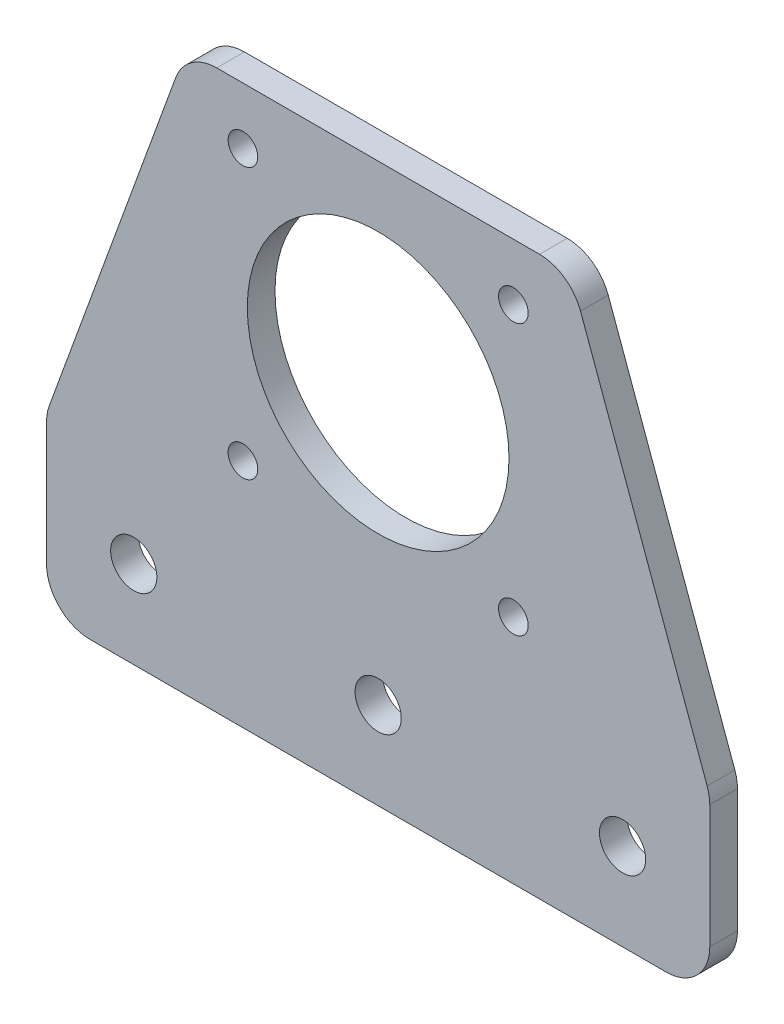
ISO-10303-21;
HEADER;
FILE_DESCRIPTION(('STEP AP214'),'2;1');
FILE_NAME('part.step','',(''),(''),'','','');
FILE_SCHEMA(('AUTOMOTIVE_DESIGN { 1 0 10303 214 1 1 1 1 }'));
ENDSEC;
DATA;
#1=APPLICATION_CONTEXT('core data for automotive mechanical design processes');
#2=APPLICATION_PROTOCOL_DEFINITION('international standard','automotive_design',2000,#1);
#3=PRODUCT_CONTEXT('',#1,'mechanical');
#4=PRODUCT('Part','Part','',(#3));
#5=PRODUCT_RELATED_PRODUCT_CATEGORY('part','',(#4));
#6=PRODUCT_DEFINITION_FORMATION('','',#4);
#7=PRODUCT_DEFINITION_CONTEXT('part definition',#1,'design');
#8=PRODUCT_DEFINITION('design','',#6,#7);
#9=PRODUCT_DEFINITION_SHAPE('','',#8);
#10=(LENGTH_UNIT() NAMED_UNIT(*) SI_UNIT(.MILLI.,.METRE.));
#11=(NAMED_UNIT(*) PLANE_ANGLE_UNIT() SI_UNIT($,.RADIAN.));
#12=(NAMED_UNIT(*) SI_UNIT($,.STERADIAN.) SOLID_ANGLE_UNIT());
#13=UNCERTAINTY_MEASURE_WITH_UNIT(LENGTH_MEASURE(1.E-05),#10,'distance_accuracy_value','');
#14=(GEOMETRIC_REPRESENTATION_CONTEXT(3) GLOBAL_UNCERTAINTY_ASSIGNED_CONTEXT((#13)) GLOBAL_UNIT_ASSIGNED_CONTEXT((#10,
#11,#12)) REPRESENTATION_CONTEXT('',''));
#15=CARTESIAN_POINT('',(0.,0.,0.));
#16=DIRECTION('',(0.,0.,1.));
#17=DIRECTION('',(1.,0.,0.));
#18=AXIS2_PLACEMENT_3D('',#15,#16,#17);
#19=CARTESIAN_POINT('',(0.,0.,3.175));
#20=DIRECTION('',(0.,0.,-1.));
#21=DIRECTION('',(-1.,0.,0.));
#22=AXIS2_PLACEMENT_3D('',#19,#20,#21);
#23=PLANE('',#22);
#24=CARTESIAN_POINT('',(0.,-32.,3.175));
#25=DIRECTION('',(0.,0.,1.));
#26=DIRECTION('',(1.,0.,0.));
#27=AXIS2_PLACEMENT_3D('',#24,#25,#26);
#28=CIRCLE('',#27,2.65);
#29=CARTESIAN_POINT('',(2.65,-32.,3.175));
#30=VERTEX_POINT('',#29);
#31=EDGE_CURVE('E520',#30,#30,#28,.T.);
#32=ORIENTED_EDGE('',*,*,#31,.F.);
#33=EDGE_LOOP('',(#32));
#34=FACE_BOUND('',#33,.T.);
#35=CARTESIAN_POINT('',(-15.5,15.5,3.175));
#36=DIRECTION('',(0.,0.,1.));
#37=DIRECTION('',(1.,0.,0.));
#38=AXIS2_PLACEMENT_3D('',#35,#36,#37);
#39=CIRCLE('',#38,1.7);
#40=CARTESIAN_POINT('',(-13.8,15.5,3.175));
#41=VERTEX_POINT('',#40);
#42=EDGE_CURVE('E528',#41,#41,#39,.T.);
#43=ORIENTED_EDGE('',*,*,#42,.F.);
#44=EDGE_LOOP('',(#43));
#45=FACE_BOUND('',#44,.T.);
#46=CARTESIAN_POINT('',(-15.5,-15.5,3.175));
#47=DIRECTION('',(0.,0.,1.));
#48=DIRECTION('',(1.,0.,0.));
#49=AXIS2_PLACEMENT_3D('',#46,#47,#48);
#50=CIRCLE('',#49,1.7);
#51=CARTESIAN_POINT('',(-13.8,-15.5,3.175));
#52=VERTEX_POINT('',#51);
#53=EDGE_CURVE('E499',#52,#52,#50,.T.);
#54=ORIENTED_EDGE('',*,*,#53,.F.);
#55=EDGE_LOOP('',(#54));
#56=FACE_BOUND('',#55,.T.);
#57=CARTESIAN_POINT('',(15.5,-15.5,3.175));
#58=DIRECTION('',(0.,0.,1.));
#59=DIRECTION('',(1.,0.,0.));
#60=AXIS2_PLACEMENT_3D('',#57,#58,#59);
#61=CIRCLE('',#60,1.7);
#62=CARTESIAN_POINT('',(17.2,-15.5,3.175));
#63=VERTEX_POINT('',#62);
#64=EDGE_CURVE('E513',#63,#63,#61,.T.);
#65=ORIENTED_EDGE('',*,*,#64,.F.);
#66=EDGE_LOOP('',(#65));
#67=FACE_BOUND('',#66,.T.);
#68=CARTESIAN_POINT('',(28.0146903077127,-32.,3.175));
#69=DIRECTION('',(0.,0.,1.));
#70=DIRECTION('',(1.,0.,0.));
#71=AXIS2_PLACEMENT_3D('',#68,#69,#70);
#72=CIRCLE('',#71,2.65);
#73=CARTESIAN_POINT('',(30.6646903077127,-32.,3.175));
#74=VERTEX_POINT('',#73);
#75=EDGE_CURVE('E541',#74,#74,#72,.T.);
#76=ORIENTED_EDGE('',*,*,#75,.F.);
#77=EDGE_LOOP('',(#76));
#78=FACE_BOUND('',#77,.T.);
#79=CARTESIAN_POINT('',(-28.0146903077127,-32.,3.175));
#80=DIRECTION('',(0.,0.,1.));
#81=DIRECTION('',(1.,0.,0.));
#82=AXIS2_PLACEMENT_3D('',#79,#80,#81);
#83=CIRCLE('',#82,2.65);
#84=CARTESIAN_POINT('',(-25.3646903077127,-32.,3.175));
#85=VERTEX_POINT('',#84);
#86=EDGE_CURVE('E534',#85,#85,#83,.T.);
#87=ORIENTED_EDGE('',*,*,#86,.F.);
#88=EDGE_LOOP('',(#87));
#89=FACE_BOUND('',#88,.T.);
#90=CARTESIAN_POINT('',(15.5,15.5,3.175));
#91=DIRECTION('',(0.,0.,1.));
#92=DIRECTION('',(1.,0.,0.));
#93=AXIS2_PLACEMENT_3D('',#90,#91,#92);
#94=CIRCLE('',#93,1.7);
#95=CARTESIAN_POINT('',(17.2,15.5,3.175));
#96=VERTEX_POINT('',#95);
#97=EDGE_CURVE('E484',#96,#96,#94,.T.);
#98=ORIENTED_EDGE('',*,*,#97,.F.);
#99=EDGE_LOOP('',(#98));
#100=FACE_BOUND('',#99,.T.);
#101=DIRECTION('',(0.,1.,0.));
#102=VECTOR('',#101,1.);
#103=CARTESIAN_POINT('',(38.0146903077128,-22.,3.175));
#104=LINE('',#103,#102);
#105=CARTESIAN_POINT('',(38.0146903077128,-37.,3.175));
#106=VERTEX_POINT('',#105);
#107=CARTESIAN_POINT('',(38.0146903077128,-22.8816349035423,3.175));
#108=VERTEX_POINT('',#107);
#109=EDGE_CURVE('E165',#106,#108,#104,.T.);
#110=ORIENTED_EDGE('',*,*,#109,.T.);
#111=CARTESIAN_POINT('',(33.0146903077128,-22.8816349035423,3.175));
#112=DIRECTION('',(0.,0.,-1.));
#113=DIRECTION('',(-1.,0.,0.));
#114=AXIS2_PLACEMENT_3D('',#111,#112,#113);
#115=CIRCLE('',#114,5.);
#116=CARTESIAN_POINT('',(37.7131534116423,-21.171534186914,3.175));
#117=VERTEX_POINT('',#116);
#118=EDGE_CURVE('E203',#108,#117,#115,.F.);
#119=ORIENTED_EDGE('',*,*,#118,.T.);
#120=DIRECTION('',(-0.342020143325666,0.939692620785909,0.));
#121=VECTOR('',#120,1.);
#122=CARTESIAN_POINT('',(22.,22.,3.175));
#123=LINE('',#122,#121);
#124=CARTESIAN_POINT('',(23.197425412881,18.7101007166283,3.175));
#125=VERTEX_POINT('',#124);
#126=EDGE_CURVE('E147',#117,#125,#123,.T.);
#127=ORIENTED_EDGE('',*,*,#126,.T.);
#128=CARTESIAN_POINT('',(18.4989623089514,17.,3.175));
#129=DIRECTION('',(0.,0.,-1.));
#130=DIRECTION('',(-1.,0.,0.));
#131=AXIS2_PLACEMENT_3D('',#128,#129,#130);
#132=CIRCLE('',#131,5.);
#133=CARTESIAN_POINT('',(18.4989623089514,22.,3.175));
#134=VERTEX_POINT('',#133);
#135=EDGE_CURVE('E192',#125,#134,#132,.F.);
#136=ORIENTED_EDGE('',*,*,#135,.T.);
#137=DIRECTION('',(-1.,0.,0.));
#138=VECTOR('',#137,1.);
#139=CARTESIAN_POINT('',(-22.,22.,3.175));
#140=LINE('',#139,#138);
#141=CARTESIAN_POINT('',(-18.4989623089514,22.,3.175));
#142=VERTEX_POINT('',#141);
#143=EDGE_CURVE('E226',#134,#142,#140,.T.);
#144=ORIENTED_EDGE('',*,*,#143,.T.);
#145=CARTESIAN_POINT('',(-18.4989623089514,17.,3.175));
#146=DIRECTION('',(0.,0.,-1.));
#147=DIRECTION('',(-1.,0.,0.));
#148=AXIS2_PLACEMENT_3D('',#145,#146,#147);
#149=CIRCLE('',#148,5.);
#150=CARTESIAN_POINT('',(-23.197425412881,18.7101007166283,3.175));
#151=VERTEX_POINT('',#150);
#152=EDGE_CURVE('E195',#142,#151,#149,.F.);
#153=ORIENTED_EDGE('',*,*,#152,.T.);
#154=DIRECTION('',(-0.342020143325665,-0.93969262078591,0.));
#155=VECTOR('',#154,1.);
#156=CARTESIAN_POINT('',(-38.0146903077127,-22.,3.175));
#157=LINE('',#156,#155);
#158=CARTESIAN_POINT('',(-37.7131534116423,-21.171534186914,3.175));
#159=VERTEX_POINT('',#158);
#160=EDGE_CURVE('E239',#151,#159,#157,.T.);
#161=ORIENTED_EDGE('',*,*,#160,.T.);
#162=CARTESIAN_POINT('',(-33.0146903077127,-22.8816349035423,3.175));
#163=DIRECTION('',(0.,0.,-1.));
#164=DIRECTION('',(-1.,0.,0.));
#165=AXIS2_PLACEMENT_3D('',#162,#163,#164);
#166=CIRCLE('',#165,5.);
#167=CARTESIAN_POINT('',(-38.0146903077127,-22.8816349035423,3.175));
#168=VERTEX_POINT('',#167);
#169=EDGE_CURVE('E189',#159,#168,#166,.F.);
#170=ORIENTED_EDGE('',*,*,#169,.T.);
#171=DIRECTION('',(0.,-1.,0.));
#172=VECTOR('',#171,1.);
#173=CARTESIAN_POINT('',(-38.0146903077127,-42.,3.175));
#174=LINE('',#173,#172);
#175=CARTESIAN_POINT('',(-38.0146903077127,-37.,3.175));
#176=VERTEX_POINT('',#175);
#177=EDGE_CURVE('E242',#168,#176,#174,.T.);
#178=ORIENTED_EDGE('',*,*,#177,.T.);
#179=CARTESIAN_POINT('',(-33.0146903077127,-37.,3.175));
#180=DIRECTION('',(0.,0.,-1.));
#181=DIRECTION('',(-1.,0.,0.));
#182=AXIS2_PLACEMENT_3D('',#179,#180,#181);
#183=CIRCLE('',#182,5.);
#184=CARTESIAN_POINT('',(-33.0146903077127,-42.,3.175));
#185=VERTEX_POINT('',#184);
#186=EDGE_CURVE('E59',#176,#185,#183,.F.);
#187=ORIENTED_EDGE('',*,*,#186,.T.);
#188=DIRECTION('',(1.,0.,0.));
#189=VECTOR('',#188,1.);
#190=CARTESIAN_POINT('',(38.0146903077128,-42.,3.175));
#191=LINE('',#190,#189);
#192=CARTESIAN_POINT('',(33.0146903077128,-42.,3.175));
#193=VERTEX_POINT('',#192);
#194=EDGE_CURVE('E245',#185,#193,#191,.T.);
#195=ORIENTED_EDGE('',*,*,#194,.T.);
#196=CARTESIAN_POINT('',(33.0146903077128,-37.,3.175));
#197=DIRECTION('',(0.,0.,-1.));
#198=DIRECTION('',(-1.,0.,0.));
#199=AXIS2_PLACEMENT_3D('',#196,#197,#198);
#200=CIRCLE('',#199,5.);
#201=EDGE_CURVE('E200',#193,#106,#200,.F.);
#202=ORIENTED_EDGE('',*,*,#201,.T.);
#203=EDGE_LOOP('',(#110,#119,#127,#136,#144,#153,#161,#170,#178,#187,#195,#202));
#204=FACE_BOUND('',#203,.T.);
#205=CARTESIAN_POINT('',(0.,0.,3.175));
#206=DIRECTION('',(0.,0.,1.));
#207=DIRECTION('',(1.,0.,0.));
#208=AXIS2_PLACEMENT_3D('',#205,#206,#207);
#209=CIRCLE('',#208,15.);
#210=CARTESIAN_POINT('',(15.,0.,3.175));
#211=VERTEX_POINT('',#210);
#212=EDGE_CURVE('E156',#211,#211,#209,.T.);
#213=ORIENTED_EDGE('',*,*,#212,.F.);
#214=EDGE_LOOP('',(#213));
#215=FACE_BOUND('',#214,.T.);
#216=ADVANCED_FACE('F37',(#34,#45,#56,#67,#78,#89,#100,#204,#215),#23,.F.);
#217=CARTESIAN_POINT('',(0.,0.,0.));
#218=DIRECTION('',(0.,0.,-1.));
#219=DIRECTION('',(-1.,0.,0.));
#220=AXIS2_PLACEMENT_3D('',#217,#218,#219);
#221=PLANE('',#220);
#222=CARTESIAN_POINT('',(0.,-32.,0.));
#223=DIRECTION('',(0.,0.,1.));
#224=DIRECTION('',(1.,0.,0.));
#225=AXIS2_PLACEMENT_3D('',#222,#223,#224);
#226=CIRCLE('',#225,2.65);
#227=CARTESIAN_POINT('',(2.65,-32.,0.));
#228=VERTEX_POINT('',#227);
#229=EDGE_CURVE('E525',#228,#228,#226,.T.);
#230=ORIENTED_EDGE('',*,*,#229,.T.);
#231=EDGE_LOOP('',(#230));
#232=FACE_BOUND('',#231,.T.);
#233=CARTESIAN_POINT('',(-15.5,15.5,0.));
#234=DIRECTION('',(0.,0.,1.));
#235=DIRECTION('',(1.,0.,0.));
#236=AXIS2_PLACEMENT_3D('',#233,#234,#235);
#237=CIRCLE('',#236,1.7);
#238=CARTESIAN_POINT('',(-13.8,15.5,0.));
#239=VERTEX_POINT('',#238);
#240=EDGE_CURVE('E505',#239,#239,#237,.T.);
#241=ORIENTED_EDGE('',*,*,#240,.T.);
#242=EDGE_LOOP('',(#241));
#243=FACE_BOUND('',#242,.T.);
#244=CARTESIAN_POINT('',(-15.5,-15.5,0.));
#245=DIRECTION('',(0.,0.,1.));
#246=DIRECTION('',(1.,0.,0.));
#247=AXIS2_PLACEMENT_3D('',#244,#245,#246);
#248=CIRCLE('',#247,1.7);
#249=CARTESIAN_POINT('',(-13.8,-15.5,0.));
#250=VERTEX_POINT('',#249);
#251=EDGE_CURVE('E504',#250,#250,#248,.T.);
#252=ORIENTED_EDGE('',*,*,#251,.T.);
#253=EDGE_LOOP('',(#252));
#254=FACE_BOUND('',#253,.T.);
#255=CARTESIAN_POINT('',(15.5,-15.5,0.));
#256=DIRECTION('',(0.,0.,1.));
#257=DIRECTION('',(1.,0.,0.));
#258=AXIS2_PLACEMENT_3D('',#255,#256,#257);
#259=CIRCLE('',#258,1.7);
#260=CARTESIAN_POINT('',(17.2,-15.5,0.));
#261=VERTEX_POINT('',#260);
#262=EDGE_CURVE('E497',#261,#261,#259,.T.);
#263=ORIENTED_EDGE('',*,*,#262,.T.);
#264=EDGE_LOOP('',(#263));
#265=FACE_BOUND('',#264,.T.);
#266=CARTESIAN_POINT('',(28.0146903077127,-32.,0.));
#267=DIRECTION('',(0.,0.,1.));
#268=DIRECTION('',(1.,0.,0.));
#269=AXIS2_PLACEMENT_3D('',#266,#267,#268);
#270=CIRCLE('',#269,2.65);
#271=CARTESIAN_POINT('',(30.6646903077127,-32.,0.));
#272=VERTEX_POINT('',#271);
#273=EDGE_CURVE('E526',#272,#272,#270,.T.);
#274=ORIENTED_EDGE('',*,*,#273,.T.);
#275=EDGE_LOOP('',(#274));
#276=FACE_BOUND('',#275,.T.);
#277=CARTESIAN_POINT('',(-28.0146903077127,-32.,0.));
#278=DIRECTION('',(0.,0.,1.));
#279=DIRECTION('',(1.,0.,0.));
#280=AXIS2_PLACEMENT_3D('',#277,#278,#279);
#281=CIRCLE('',#280,2.65);
#282=CARTESIAN_POINT('',(-25.3646903077127,-32.,0.));
#283=VERTEX_POINT('',#282);
#284=EDGE_CURVE('E539',#283,#283,#281,.T.);
#285=ORIENTED_EDGE('',*,*,#284,.T.);
#286=EDGE_LOOP('',(#285));
#287=FACE_BOUND('',#286,.T.);
#288=CARTESIAN_POINT('',(15.5,15.5,0.));
#289=DIRECTION('',(0.,0.,1.));
#290=DIRECTION('',(1.,0.,0.));
#291=AXIS2_PLACEMENT_3D('',#288,#289,#290);
#292=CIRCLE('',#291,1.7);
#293=CARTESIAN_POINT('',(17.2,15.5,0.));
#294=VERTEX_POINT('',#293);
#295=EDGE_CURVE('E481',#294,#294,#292,.T.);
#296=ORIENTED_EDGE('',*,*,#295,.T.);
#297=EDGE_LOOP('',(#296));
#298=FACE_BOUND('',#297,.T.);
#299=DIRECTION('',(-0.342020143325666,0.939692620785909,0.));
#300=VECTOR('',#299,1.);
#301=CARTESIAN_POINT('',(22.,22.,0.));
#302=LINE('',#301,#300);
#303=CARTESIAN_POINT('',(37.7131534116423,-21.171534186914,0.));
#304=VERTEX_POINT('',#303);
#305=CARTESIAN_POINT('',(23.197425412881,18.7101007166283,0.));
#306=VERTEX_POINT('',#305);
#307=EDGE_CURVE('E144',#304,#306,#302,.T.);
#308=ORIENTED_EDGE('',*,*,#307,.F.);
#309=CARTESIAN_POINT('',(33.0146903077128,-22.8816349035423,0.));
#310=DIRECTION('',(0.,0.,-1.));
#311=DIRECTION('',(-1.,0.,0.));
#312=AXIS2_PLACEMENT_3D('',#309,#310,#311);
#313=CIRCLE('',#312,5.);
#314=CARTESIAN_POINT('',(38.0146903077128,-22.8816349035423,0.));
#315=VERTEX_POINT('',#314);
#316=EDGE_CURVE('E127',#304,#315,#313,.T.);
#317=ORIENTED_EDGE('',*,*,#316,.T.);
#318=DIRECTION('',(0.,1.,0.));
#319=VECTOR('',#318,1.);
#320=CARTESIAN_POINT('',(38.0146903077128,-22.,0.));
#321=LINE('',#320,#319);
#322=CARTESIAN_POINT('',(38.0146903077128,-37.,0.));
#323=VERTEX_POINT('',#322);
#324=EDGE_CURVE('E176',#323,#315,#321,.T.);
#325=ORIENTED_EDGE('',*,*,#324,.F.);
#326=CARTESIAN_POINT('',(33.0146903077128,-37.,0.));
#327=DIRECTION('',(0.,0.,-1.));
#328=DIRECTION('',(-1.,0.,0.));
#329=AXIS2_PLACEMENT_3D('',#326,#327,#328);
#330=CIRCLE('',#329,5.);
#331=CARTESIAN_POINT('',(33.0146903077128,-42.,0.));
#332=VERTEX_POINT('',#331);
#333=EDGE_CURVE('E138',#323,#332,#330,.T.);
#334=ORIENTED_EDGE('',*,*,#333,.T.);
#335=DIRECTION('',(1.,0.,0.));
#336=VECTOR('',#335,1.);
#337=CARTESIAN_POINT('',(38.0146903077128,-42.,0.));
#338=LINE('',#337,#336);
#339=CARTESIAN_POINT('',(-33.0146903077127,-42.,0.));
#340=VERTEX_POINT('',#339);
#341=EDGE_CURVE('E174',#340,#332,#338,.T.);
#342=ORIENTED_EDGE('',*,*,#341,.F.);
#343=CARTESIAN_POINT('',(-33.0146903077127,-37.,0.));
#344=DIRECTION('',(0.,0.,-1.));
#345=DIRECTION('',(-1.,0.,0.));
#346=AXIS2_PLACEMENT_3D('',#343,#344,#345);
#347=CIRCLE('',#346,5.);
#348=CARTESIAN_POINT('',(-38.0146903077127,-37.,0.));
#349=VERTEX_POINT('',#348);
#350=EDGE_CURVE('E183',#340,#349,#347,.T.);
#351=ORIENTED_EDGE('',*,*,#350,.T.);
#352=DIRECTION('',(0.,-1.,0.));
#353=VECTOR('',#352,1.);
#354=CARTESIAN_POINT('',(-38.0146903077127,-42.,0.));
#355=LINE('',#354,#353);
#356=CARTESIAN_POINT('',(-38.0146903077127,-22.8816349035423,0.));
#357=VERTEX_POINT('',#356);
#358=EDGE_CURVE('E171',#357,#349,#355,.T.);
#359=ORIENTED_EDGE('',*,*,#358,.F.);
#360=CARTESIAN_POINT('',(-33.0146903077127,-22.8816349035423,0.));
#361=DIRECTION('',(0.,0.,-1.));
#362=DIRECTION('',(-1.,0.,0.));
#363=AXIS2_PLACEMENT_3D('',#360,#361,#362);
#364=CIRCLE('',#363,5.);
#365=CARTESIAN_POINT('',(-37.7131534116423,-21.171534186914,0.));
#366=VERTEX_POINT('',#365);
#367=EDGE_CURVE('E148',#357,#366,#364,.T.);
#368=ORIENTED_EDGE('',*,*,#367,.T.);
#369=DIRECTION('',(-0.342020143325665,-0.93969262078591,0.));
#370=VECTOR('',#369,1.);
#371=CARTESIAN_POINT('',(-38.0146903077127,-22.,0.));
#372=LINE('',#371,#370);
#373=CARTESIAN_POINT('',(-23.197425412881,18.7101007166283,0.));
#374=VERTEX_POINT('',#373);
#375=EDGE_CURVE('E159',#374,#366,#372,.T.);
#376=ORIENTED_EDGE('',*,*,#375,.F.);
#377=CARTESIAN_POINT('',(-18.4989623089514,17.,0.));
#378=DIRECTION('',(0.,0.,-1.));
#379=DIRECTION('',(-1.,0.,0.));
#380=AXIS2_PLACEMENT_3D('',#377,#378,#379);
#381=CIRCLE('',#380,5.);
#382=CARTESIAN_POINT('',(-18.4989623089514,22.,0.));
#383=VERTEX_POINT('',#382);
#384=EDGE_CURVE('E181',#374,#383,#381,.T.);
#385=ORIENTED_EDGE('',*,*,#384,.T.);
#386=DIRECTION('',(-1.,0.,0.));
#387=VECTOR('',#386,1.);
#388=CARTESIAN_POINT('',(-22.,22.,0.));
#389=LINE('',#388,#387);
#390=CARTESIAN_POINT('',(18.4989623089514,22.,0.));
#391=VERTEX_POINT('',#390);
#392=EDGE_CURVE('E155',#391,#383,#389,.T.);
#393=ORIENTED_EDGE('',*,*,#392,.F.);
#394=CARTESIAN_POINT('',(18.4989623089514,17.,0.));
#395=DIRECTION('',(0.,0.,-1.));
#396=DIRECTION('',(-1.,0.,0.));
#397=AXIS2_PLACEMENT_3D('',#394,#395,#396);
#398=CIRCLE('',#397,5.);
#399=EDGE_CURVE('E154',#391,#306,#398,.T.);
#400=ORIENTED_EDGE('',*,*,#399,.T.);
#401=EDGE_LOOP('',(#308,#317,#325,#334,#342,#351,#359,#368,#376,#385,#393,#400));
#402=FACE_BOUND('',#401,.T.);
#403=CARTESIAN_POINT('',(0.,0.,0.));
#404=DIRECTION('',(0.,0.,1.));
#405=DIRECTION('',(1.,0.,0.));
#406=AXIS2_PLACEMENT_3D('',#403,#404,#405);
#407=CIRCLE('',#406,15.);
#408=CARTESIAN_POINT('',(15.,0.,0.));
#409=VERTEX_POINT('',#408);
#410=EDGE_CURVE('E163',#409,#409,#407,.T.);
#411=ORIENTED_EDGE('',*,*,#410,.T.);
#412=EDGE_LOOP('',(#411));
#413=FACE_BOUND('',#412,.T.);
#414=ADVANCED_FACE('F151',(#232,#243,#254,#265,#276,#287,#298,#402,#413),#221,.T.);
#415=CARTESIAN_POINT('',(22.,22.,3.175));
#416=DIRECTION('',(-0.939692620785909,-0.342020143325666,0.));
#417=DIRECTION('',(0.342020143325666,-0.939692620785909,0.));
#418=AXIS2_PLACEMENT_3D('',#415,#416,#417);
#419=PLANE('',#418);
#420=ORIENTED_EDGE('',*,*,#126,.F.);
#421=DIRECTION('',(0.,0.,-1.));
#422=VECTOR('',#421,1.);
#423=CARTESIAN_POINT('',(37.7131534116423,-21.171534186914,3.175));
#424=LINE('',#423,#422);
#425=EDGE_CURVE('E131',#117,#304,#424,.T.);
#426=ORIENTED_EDGE('',*,*,#425,.T.);
#427=ORIENTED_EDGE('',*,*,#307,.T.);
#428=DIRECTION('',(0.,0.,-1.));
#429=VECTOR('',#428,1.);
#430=CARTESIAN_POINT('',(23.197425412881,18.7101007166283,3.175));
#431=LINE('',#430,#429);
#432=EDGE_CURVE('E149',#306,#125,#431,.F.);
#433=ORIENTED_EDGE('',*,*,#432,.T.);
#434=EDGE_LOOP('',(#420,#426,#427,#433));
#435=FACE_BOUND('',#434,.T.);
#436=ADVANCED_FACE('F143',(#435),#419,.F.);
#437=CARTESIAN_POINT('',(-22.,22.,3.175));
#438=DIRECTION('',(0.,-1.,0.));
#439=DIRECTION('',(0.,0.,-1.));
#440=AXIS2_PLACEMENT_3D('',#437,#438,#439);
#441=PLANE('',#440);
#442=ORIENTED_EDGE('',*,*,#392,.T.);
#443=DIRECTION('',(0.,0.,-1.));
#444=VECTOR('',#443,1.);
#445=CARTESIAN_POINT('',(-18.4989623089514,22.,3.175));
#446=LINE('',#445,#444);
#447=EDGE_CURVE('E12',#383,#142,#446,.F.);
#448=ORIENTED_EDGE('',*,*,#447,.T.);
#449=ORIENTED_EDGE('',*,*,#143,.F.);
#450=DIRECTION('',(0.,0.,-1.));
#451=VECTOR('',#450,1.);
#452=CARTESIAN_POINT('',(18.4989623089514,22.,3.175));
#453=LINE('',#452,#451);
#454=EDGE_CURVE('E45',#134,#391,#453,.T.);
#455=ORIENTED_EDGE('',*,*,#454,.T.);
#456=EDGE_LOOP('',(#442,#448,#449,#455));
#457=FACE_BOUND('',#456,.T.);
#458=ADVANCED_FACE('F223',(#457),#441,.F.);
#459=CARTESIAN_POINT('',(-38.0146903077127,-22.,3.175));
#460=DIRECTION('',(0.939692620785909,-0.342020143325665,0.));
#461=DIRECTION('',(0.342020143325665,0.93969262078591,0.));
#462=AXIS2_PLACEMENT_3D('',#459,#460,#461);
#463=PLANE('',#462);
#464=ORIENTED_EDGE('',*,*,#160,.F.);
#465=DIRECTION('',(0.,0.,-1.));
#466=VECTOR('',#465,1.);
#467=CARTESIAN_POINT('',(-23.197425412881,18.7101007166283,3.175));
#468=LINE('',#467,#466);
#469=EDGE_CURVE('E217',#151,#374,#468,.T.);
#470=ORIENTED_EDGE('',*,*,#469,.T.);
#471=ORIENTED_EDGE('',*,*,#375,.T.);
#472=DIRECTION('',(0.,0.,-1.));
#473=VECTOR('',#472,1.);
#474=CARTESIAN_POINT('',(-37.7131534116423,-21.171534186914,3.175));
#475=LINE('',#474,#473);
#476=EDGE_CURVE('E215',#366,#159,#475,.F.);
#477=ORIENTED_EDGE('',*,*,#476,.T.);
#478=EDGE_LOOP('',(#464,#470,#471,#477));
#479=FACE_BOUND('',#478,.T.);
#480=ADVANCED_FACE('F236',(#479),#463,.F.);
#481=CARTESIAN_POINT('',(-38.0146903077127,-42.,3.175));
#482=DIRECTION('',(1.,0.,0.));
#483=DIRECTION('',(0.,1.,0.));
#484=AXIS2_PLACEMENT_3D('',#481,#482,#483);
#485=PLANE('',#484);
#486=ORIENTED_EDGE('',*,*,#358,.T.);
#487=DIRECTION('',(0.,0.,-1.));
#488=VECTOR('',#487,1.);
#489=CARTESIAN_POINT('',(-38.0146903077127,-37.,3.175));
#490=LINE('',#489,#488);
#491=EDGE_CURVE('E213',#349,#176,#490,.F.);
#492=ORIENTED_EDGE('',*,*,#491,.T.);
#493=ORIENTED_EDGE('',*,*,#177,.F.);
#494=DIRECTION('',(0.,0.,-1.));
#495=VECTOR('',#494,1.);
#496=CARTESIAN_POINT('',(-38.0146903077127,-22.8816349035423,3.175));
#497=LINE('',#496,#495);
#498=EDGE_CURVE('E210',#168,#357,#497,.T.);
#499=ORIENTED_EDGE('',*,*,#498,.T.);
#500=EDGE_LOOP('',(#486,#492,#493,#499));
#501=FACE_BOUND('',#500,.T.);
#502=ADVANCED_FACE('F278',(#501),#485,.F.);
#503=CARTESIAN_POINT('',(38.0146903077128,-42.,3.175));
#504=DIRECTION('',(0.,1.,0.));
#505=DIRECTION('',(-1.,0.,0.));
#506=AXIS2_PLACEMENT_3D('',#503,#504,#505);
#507=PLANE('',#506);
#508=ORIENTED_EDGE('',*,*,#341,.T.);
#509=DIRECTION('',(0.,0.,-1.));
#510=VECTOR('',#509,1.);
#511=CARTESIAN_POINT('',(33.0146903077128,-42.,3.175));
#512=LINE('',#511,#510);
#513=EDGE_CURVE('E52',#332,#193,#512,.F.);
#514=ORIENTED_EDGE('',*,*,#513,.T.);
#515=ORIENTED_EDGE('',*,*,#194,.F.);
#516=DIRECTION('',(0.,0.,-1.));
#517=VECTOR('',#516,1.);
#518=CARTESIAN_POINT('',(-33.0146903077127,-42.,3.175));
#519=LINE('',#518,#517);
#520=EDGE_CURVE('E206',#185,#340,#519,.T.);
#521=ORIENTED_EDGE('',*,*,#520,.T.);
#522=EDGE_LOOP('',(#508,#514,#515,#521));
#523=FACE_BOUND('',#522,.T.);
#524=ADVANCED_FACE('F271',(#523),#507,.F.);
#525=CARTESIAN_POINT('',(38.0146903077128,-22.,3.175));
#526=DIRECTION('',(-1.,0.,0.));
#527=DIRECTION('',(0.,-1.,0.));
#528=AXIS2_PLACEMENT_3D('',#525,#526,#527);
#529=PLANE('',#528);
#530=ORIENTED_EDGE('',*,*,#324,.T.);
#531=DIRECTION('',(0.,0.,-1.));
#532=VECTOR('',#531,1.);
#533=CARTESIAN_POINT('',(38.0146903077128,-22.8816349035423,3.175));
#534=LINE('',#533,#532);
#535=EDGE_CURVE('E132',#315,#108,#534,.F.);
#536=ORIENTED_EDGE('',*,*,#535,.T.);
#537=ORIENTED_EDGE('',*,*,#109,.F.);
#538=DIRECTION('',(0.,0.,-1.));
#539=VECTOR('',#538,1.);
#540=CARTESIAN_POINT('',(38.0146903077128,-37.,3.175));
#541=LINE('',#540,#539);
#542=EDGE_CURVE('E137',#106,#323,#541,.T.);
#543=ORIENTED_EDGE('',*,*,#542,.T.);
#544=EDGE_LOOP('',(#530,#536,#537,#543));
#545=FACE_BOUND('',#544,.T.);
#546=ADVANCED_FACE('F267',(#545),#529,.F.);
#547=CARTESIAN_POINT('',(0.,0.,3.175));
#548=DIRECTION('',(0.,0.,-1.));
#549=DIRECTION('',(-1.,0.,0.));
#550=AXIS2_PLACEMENT_3D('',#547,#548,#549);
#551=CYLINDRICAL_SURFACE('',#550,15.);
#552=ORIENTED_EDGE('',*,*,#212,.T.);
#553=EDGE_LOOP('',(#552));
#554=FACE_BOUND('',#553,.T.);
#555=ORIENTED_EDGE('',*,*,#410,.F.);
#556=EDGE_LOOP('',(#555));
#557=FACE_BOUND('',#556,.T.);
#558=ADVANCED_FACE('F298',(#554,#557),#551,.F.);
#559=CARTESIAN_POINT('',(15.5,15.5,0.));
#560=DIRECTION('',(0.,0.,1.));
#561=DIRECTION('',(1.,0.,0.));
#562=AXIS2_PLACEMENT_3D('',#559,#560,#561);
#563=CYLINDRICAL_SURFACE('',#562,1.7);
#564=ORIENTED_EDGE('',*,*,#295,.F.);
#565=EDGE_LOOP('',(#564));
#566=FACE_BOUND('',#565,.T.);
#567=ORIENTED_EDGE('',*,*,#97,.T.);
#568=EDGE_LOOP('',(#567));
#569=FACE_BOUND('',#568,.T.);
#570=ADVANCED_FACE('F405',(#566,#569),#563,.F.);
#571=CARTESIAN_POINT('',(-28.0146903077127,-32.,0.));
#572=DIRECTION('',(0.,0.,1.));
#573=DIRECTION('',(1.,0.,0.));
#574=AXIS2_PLACEMENT_3D('',#571,#572,#573);
#575=CYLINDRICAL_SURFACE('',#574,2.65);
#576=ORIENTED_EDGE('',*,*,#284,.F.);
#577=EDGE_LOOP('',(#576));
#578=FACE_BOUND('',#577,.T.);
#579=ORIENTED_EDGE('',*,*,#86,.T.);
#580=EDGE_LOOP('',(#579));
#581=FACE_BOUND('',#580,.T.);
#582=ADVANCED_FACE('F396',(#578,#581),#575,.F.);
#583=CARTESIAN_POINT('',(28.0146903077127,-32.,0.));
#584=DIRECTION('',(0.,0.,1.));
#585=DIRECTION('',(1.,0.,0.));
#586=AXIS2_PLACEMENT_3D('',#583,#584,#585);
#587=CYLINDRICAL_SURFACE('',#586,2.65);
#588=ORIENTED_EDGE('',*,*,#273,.F.);
#589=EDGE_LOOP('',(#588));
#590=FACE_BOUND('',#589,.T.);
#591=ORIENTED_EDGE('',*,*,#75,.T.);
#592=EDGE_LOOP('',(#591));
#593=FACE_BOUND('',#592,.T.);
#594=ADVANCED_FACE('F387',(#590,#593),#587,.F.);
#595=CARTESIAN_POINT('',(15.5,-15.5,0.));
#596=DIRECTION('',(0.,0.,1.));
#597=DIRECTION('',(1.,0.,0.));
#598=AXIS2_PLACEMENT_3D('',#595,#596,#597);
#599=CYLINDRICAL_SURFACE('',#598,1.7);
#600=ORIENTED_EDGE('',*,*,#262,.F.);
#601=EDGE_LOOP('',(#600));
#602=FACE_BOUND('',#601,.T.);
#603=ORIENTED_EDGE('',*,*,#64,.T.);
#604=EDGE_LOOP('',(#603));
#605=FACE_BOUND('',#604,.T.);
#606=ADVANCED_FACE('F378',(#602,#605),#599,.F.);
#607=CARTESIAN_POINT('',(-15.5,-15.5,0.));
#608=DIRECTION('',(0.,0.,1.));
#609=DIRECTION('',(1.,0.,0.));
#610=AXIS2_PLACEMENT_3D('',#607,#608,#609);
#611=CYLINDRICAL_SURFACE('',#610,1.7);
#612=ORIENTED_EDGE('',*,*,#251,.F.);
#613=EDGE_LOOP('',(#612));
#614=FACE_BOUND('',#613,.T.);
#615=ORIENTED_EDGE('',*,*,#53,.T.);
#616=EDGE_LOOP('',(#615));
#617=FACE_BOUND('',#616,.T.);
#618=ADVANCED_FACE('F369',(#614,#617),#611,.F.);
#619=CARTESIAN_POINT('',(-15.5,15.5,0.));
#620=DIRECTION('',(0.,0.,1.));
#621=DIRECTION('',(1.,0.,0.));
#622=AXIS2_PLACEMENT_3D('',#619,#620,#621);
#623=CYLINDRICAL_SURFACE('',#622,1.7);
#624=ORIENTED_EDGE('',*,*,#240,.F.);
#625=EDGE_LOOP('',(#624));
#626=FACE_BOUND('',#625,.T.);
#627=ORIENTED_EDGE('',*,*,#42,.T.);
#628=EDGE_LOOP('',(#627));
#629=FACE_BOUND('',#628,.T.);
#630=ADVANCED_FACE('F360',(#626,#629),#623,.F.);
#631=CARTESIAN_POINT('',(0.,-32.,0.));
#632=DIRECTION('',(0.,0.,1.));
#633=DIRECTION('',(1.,0.,0.));
#634=AXIS2_PLACEMENT_3D('',#631,#632,#633);
#635=CYLINDRICAL_SURFACE('',#634,2.65);
#636=ORIENTED_EDGE('',*,*,#229,.F.);
#637=EDGE_LOOP('',(#636));
#638=FACE_BOUND('',#637,.T.);
#639=ORIENTED_EDGE('',*,*,#31,.T.);
#640=EDGE_LOOP('',(#639));
#641=FACE_BOUND('',#640,.T.);
#642=ADVANCED_FACE('F315',(#638,#641),#635,.F.);
#643=CARTESIAN_POINT('',(33.0146903077128,-22.8816349035423,3.175));
#644=DIRECTION('',(0.,0.,-1.));
#645=DIRECTION('',(-1.,0.,0.));
#646=AXIS2_PLACEMENT_3D('',#643,#644,#645);
#647=CYLINDRICAL_SURFACE('',#646,5.);
#648=ORIENTED_EDGE('',*,*,#118,.F.);
#649=ORIENTED_EDGE('',*,*,#535,.F.);
#650=ORIENTED_EDGE('',*,*,#316,.F.);
#651=ORIENTED_EDGE('',*,*,#425,.F.);
#652=EDGE_LOOP('',(#648,#649,#650,#651));
#653=FACE_BOUND('',#652,.T.);
#654=ADVANCED_FACE('F130',(#653),#647,.T.);
#655=CARTESIAN_POINT('',(33.0146903077128,-37.,3.175));
#656=DIRECTION('',(0.,0.,-1.));
#657=DIRECTION('',(-1.,0.,0.));
#658=AXIS2_PLACEMENT_3D('',#655,#656,#657);
#659=CYLINDRICAL_SURFACE('',#658,5.);
#660=ORIENTED_EDGE('',*,*,#201,.F.);
#661=ORIENTED_EDGE('',*,*,#513,.F.);
#662=ORIENTED_EDGE('',*,*,#333,.F.);
#663=ORIENTED_EDGE('',*,*,#542,.F.);
#664=EDGE_LOOP('',(#660,#661,#662,#663));
#665=FACE_BOUND('',#664,.T.);
#666=ADVANCED_FACE('F269',(#665),#659,.T.);
#667=CARTESIAN_POINT('',(-33.0146903077127,-37.,3.175));
#668=DIRECTION('',(0.,0.,-1.));
#669=DIRECTION('',(-1.,0.,0.));
#670=AXIS2_PLACEMENT_3D('',#667,#668,#669);
#671=CYLINDRICAL_SURFACE('',#670,5.);
#672=ORIENTED_EDGE('',*,*,#186,.F.);
#673=ORIENTED_EDGE('',*,*,#491,.F.);
#674=ORIENTED_EDGE('',*,*,#350,.F.);
#675=ORIENTED_EDGE('',*,*,#520,.F.);
#676=EDGE_LOOP('',(#672,#673,#674,#675));
#677=FACE_BOUND('',#676,.T.);
#678=ADVANCED_FACE('F274',(#677),#671,.T.);
#679=CARTESIAN_POINT('',(-18.4989623089514,17.,3.175));
#680=DIRECTION('',(0.,0.,-1.));
#681=DIRECTION('',(-1.,0.,0.));
#682=AXIS2_PLACEMENT_3D('',#679,#680,#681);
#683=CYLINDRICAL_SURFACE('',#682,5.);
#684=ORIENTED_EDGE('',*,*,#152,.F.);
#685=ORIENTED_EDGE('',*,*,#447,.F.);
#686=ORIENTED_EDGE('',*,*,#384,.F.);
#687=ORIENTED_EDGE('',*,*,#469,.F.);
#688=EDGE_LOOP('',(#684,#685,#686,#687));
#689=FACE_BOUND('',#688,.T.);
#690=ADVANCED_FACE('F233',(#689),#683,.T.);
#691=CARTESIAN_POINT('',(18.4989623089514,17.,3.175));
#692=DIRECTION('',(0.,0.,-1.));
#693=DIRECTION('',(-1.,0.,0.));
#694=AXIS2_PLACEMENT_3D('',#691,#692,#693);
#695=CYLINDRICAL_SURFACE('',#694,5.);
#696=ORIENTED_EDGE('',*,*,#135,.F.);
#697=ORIENTED_EDGE('',*,*,#432,.F.);
#698=ORIENTED_EDGE('',*,*,#399,.F.);
#699=ORIENTED_EDGE('',*,*,#454,.F.);
#700=EDGE_LOOP('',(#696,#697,#698,#699));
#701=FACE_BOUND('',#700,.T.);
#702=ADVANCED_FACE('F283',(#701),#695,.T.);
#703=CARTESIAN_POINT('',(-33.0146903077127,-22.8816349035423,3.175));
#704=DIRECTION('',(0.,0.,-1.));
#705=DIRECTION('',(-1.,0.,0.));
#706=AXIS2_PLACEMENT_3D('',#703,#704,#705);
#707=CYLINDRICAL_SURFACE('',#706,5.);
#708=ORIENTED_EDGE('',*,*,#169,.F.);
#709=ORIENTED_EDGE('',*,*,#476,.F.);
#710=ORIENTED_EDGE('',*,*,#367,.F.);
#711=ORIENTED_EDGE('',*,*,#498,.F.);
#712=EDGE_LOOP('',(#708,#709,#710,#711));
#713=FACE_BOUND('',#712,.T.);
#714=ADVANCED_FACE('F39',(#713),#707,.T.);
#715=CLOSED_SHELL('',(#216,#414,#436,#458,#480,#502,#524,#546,#558,#570,#582,#594,#606,#618,
#630,#642,#654,#666,#678,#690,#702,#714));
#716=MANIFOLD_SOLID_BREP('B2',#715);
#717=ADVANCED_BREP_SHAPE_REPRESENTATION('',(#18,#716),#14);
#718=SHAPE_DEFINITION_REPRESENTATION(#9,#717);
ENDSEC;
END-ISO-10303-21;
